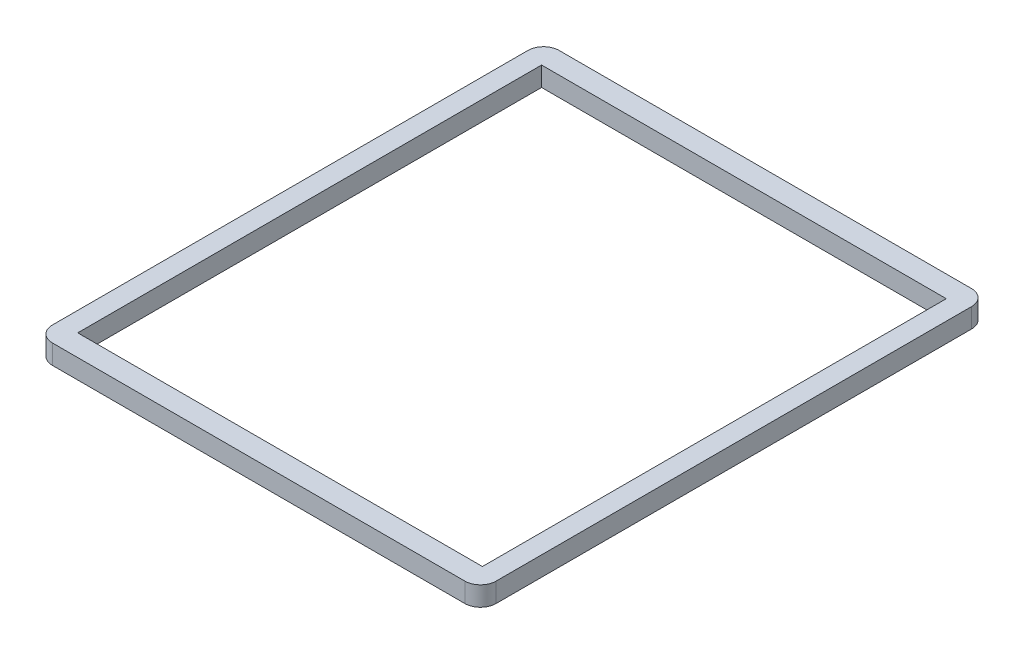
ISO-10303-21;
HEADER;
FILE_DESCRIPTION(('STEP AP214'),'2;1');
FILE_NAME('part.step','',(''),(''),'','','');
FILE_SCHEMA(('AUTOMOTIVE_DESIGN { 1 0 10303 214 1 1 1 1 }'));
ENDSEC;
DATA;
#1=APPLICATION_CONTEXT('core data for automotive mechanical design processes');
#2=APPLICATION_PROTOCOL_DEFINITION('international standard','automotive_design',2000,#1);
#3=PRODUCT_CONTEXT('',#1,'mechanical');
#4=PRODUCT('Part','Part','',(#3));
#5=PRODUCT_RELATED_PRODUCT_CATEGORY('part','',(#4));
#6=PRODUCT_DEFINITION_FORMATION('','',#4);
#7=PRODUCT_DEFINITION_CONTEXT('part definition',#1,'design');
#8=PRODUCT_DEFINITION('design','',#6,#7);
#9=PRODUCT_DEFINITION_SHAPE('','',#8);
#10=(LENGTH_UNIT() NAMED_UNIT(*) SI_UNIT(.MILLI.,.METRE.));
#11=(NAMED_UNIT(*) PLANE_ANGLE_UNIT() SI_UNIT($,.RADIAN.));
#12=(NAMED_UNIT(*) SI_UNIT($,.STERADIAN.) SOLID_ANGLE_UNIT());
#13=UNCERTAINTY_MEASURE_WITH_UNIT(LENGTH_MEASURE(1.E-05),#10,'distance_accuracy_value','');
#14=(GEOMETRIC_REPRESENTATION_CONTEXT(3) GLOBAL_UNCERTAINTY_ASSIGNED_CONTEXT((#13)) GLOBAL_UNIT_ASSIGNED_CONTEXT((#10,
#11,#12)) REPRESENTATION_CONTEXT('',''));
#15=CARTESIAN_POINT('',(0.,0.,0.));
#16=DIRECTION('',(0.,0.,1.));
#17=DIRECTION('',(1.,0.,0.));
#18=AXIS2_PLACEMENT_3D('',#15,#16,#17);
#19=CARTESIAN_POINT('',(2.54,3.175,-2.54));
#20=DIRECTION('',(0.,-1.,0.));
#21=DIRECTION('',(0.,0.,-1.));
#22=AXIS2_PLACEMENT_3D('',#19,#20,#21);
#23=PLANE('',#22);
#24=CARTESIAN_POINT('',(2.54,3.175,-2.54));
#25=DIRECTION('',(0.,1.,0.));
#26=DIRECTION('',(0.,0.,-1.));
#27=AXIS2_PLACEMENT_3D('',#24,#25,#26);
#28=CIRCLE('',#27,2.54);
#29=CARTESIAN_POINT('',(0.,3.175,-2.54000000000002));
#30=VERTEX_POINT('',#29);
#31=CARTESIAN_POINT('',(2.54000000000002,3.175,0.));
#32=VERTEX_POINT('',#31);
#33=EDGE_CURVE('E159',#30,#32,#28,.T.);
#34=ORIENTED_EDGE('',*,*,#33,.T.);
#35=DIRECTION('',(1.,0.,0.));
#36=VECTOR('',#35,1.);
#37=CARTESIAN_POINT('',(2.54000000000002,3.175,0.));
#38=LINE('',#37,#36);
#39=CARTESIAN_POINT('',(69.85,3.175,0.));
#40=VERTEX_POINT('',#39);
#41=EDGE_CURVE('E162',#32,#40,#38,.T.);
#42=ORIENTED_EDGE('',*,*,#41,.T.);
#43=CARTESIAN_POINT('',(69.85,3.175,-2.54000000000001));
#44=DIRECTION('',(0.,1.,0.));
#45=DIRECTION('',(0.,0.,-1.));
#46=AXIS2_PLACEMENT_3D('',#43,#44,#45);
#47=CIRCLE('',#46,2.54);
#48=CARTESIAN_POINT('',(72.39,3.175,-2.54000000000001));
#49=VERTEX_POINT('',#48);
#50=EDGE_CURVE('E165',#40,#49,#47,.T.);
#51=ORIENTED_EDGE('',*,*,#50,.T.);
#52=DIRECTION('',(0.,0.,-1.));
#53=VECTOR('',#52,1.);
#54=CARTESIAN_POINT('',(72.39,3.175,-2.54000000000001));
#55=LINE('',#54,#53);
#56=CARTESIAN_POINT('',(72.39,3.175,-80.137));
#57=VERTEX_POINT('',#56);
#58=EDGE_CURVE('E167',#49,#57,#55,.T.);
#59=ORIENTED_EDGE('',*,*,#58,.T.);
#60=CARTESIAN_POINT('',(69.85,3.175,-80.137));
#61=DIRECTION('',(0.,1.,0.));
#62=DIRECTION('',(0.,0.,-1.));
#63=AXIS2_PLACEMENT_3D('',#60,#61,#62);
#64=CIRCLE('',#63,2.54);
#65=CARTESIAN_POINT('',(69.85,3.175,-82.677));
#66=VERTEX_POINT('',#65);
#67=EDGE_CURVE('E169',#57,#66,#64,.T.);
#68=ORIENTED_EDGE('',*,*,#67,.T.);
#69=DIRECTION('',(-1.,0.,0.));
#70=VECTOR('',#69,1.);
#71=CARTESIAN_POINT('',(2.54000000000002,3.175,-82.677));
#72=LINE('',#71,#70);
#73=CARTESIAN_POINT('',(2.54000000000002,3.175,-82.677));
#74=VERTEX_POINT('',#73);
#75=EDGE_CURVE('E171',#66,#74,#72,.T.);
#76=ORIENTED_EDGE('',*,*,#75,.T.);
#77=CARTESIAN_POINT('',(2.54,3.175,-80.137));
#78=DIRECTION('',(0.,1.,0.));
#79=DIRECTION('',(0.,0.,1.));
#80=AXIS2_PLACEMENT_3D('',#77,#78,#79);
#81=CIRCLE('',#80,2.54);
#82=CARTESIAN_POINT('',(0.,3.175,-80.137));
#83=VERTEX_POINT('',#82);
#84=EDGE_CURVE('E173',#74,#83,#81,.T.);
#85=ORIENTED_EDGE('',*,*,#84,.T.);
#86=DIRECTION('',(0.,0.,1.));
#87=VECTOR('',#86,1.);
#88=CARTESIAN_POINT('',(0.,3.175,-2.54000000000002));
#89=LINE('',#88,#87);
#90=EDGE_CURVE('E175',#83,#30,#89,.T.);
#91=ORIENTED_EDGE('',*,*,#90,.T.);
#92=EDGE_LOOP('',(#34,#42,#51,#59,#68,#76,#85,#91));
#93=FACE_BOUND('',#92,.T.);
#94=DIRECTION('',(0.,0.,1.));
#95=VECTOR('',#94,1.);
#96=CARTESIAN_POINT('',(3.175,3.175,-3.4925));
#97=LINE('',#96,#95);
#98=CARTESIAN_POINT('',(3.175,3.175,-79.1845));
#99=VERTEX_POINT('',#98);
#100=CARTESIAN_POINT('',(3.175,3.175,-3.4925));
#101=VERTEX_POINT('',#100);
#102=EDGE_CURVE('E123',#99,#101,#97,.T.);
#103=ORIENTED_EDGE('',*,*,#102,.F.);
#104=DIRECTION('',(-1.,0.,0.));
#105=VECTOR('',#104,1.);
#106=CARTESIAN_POINT('',(69.215,3.175,-79.1845));
#107=LINE('',#106,#105);
#108=CARTESIAN_POINT('',(69.215,3.175,-79.1845));
#109=VERTEX_POINT('',#108);
#110=EDGE_CURVE('E145',#109,#99,#107,.T.);
#111=ORIENTED_EDGE('',*,*,#110,.F.);
#112=DIRECTION('',(0.,0.,-1.));
#113=VECTOR('',#112,1.);
#114=CARTESIAN_POINT('',(69.215,3.175,-3.49250000000001));
#115=LINE('',#114,#113);
#116=CARTESIAN_POINT('',(69.215,3.175,-3.49250000000001));
#117=VERTEX_POINT('',#116);
#118=EDGE_CURVE('E143',#117,#109,#115,.T.);
#119=ORIENTED_EDGE('',*,*,#118,.F.);
#120=DIRECTION('',(1.,0.,0.));
#121=VECTOR('',#120,1.);
#122=CARTESIAN_POINT('',(69.215,3.175,-3.49250000000001));
#123=LINE('',#122,#121);
#124=EDGE_CURVE('E131',#101,#117,#123,.T.);
#125=ORIENTED_EDGE('',*,*,#124,.F.);
#126=EDGE_LOOP('',(#103,#111,#119,#125));
#127=FACE_BOUND('',#126,.T.);
#128=ADVANCED_FACE('F34',(#93,#127),#23,.F.);
#129=CARTESIAN_POINT('',(2.54,0.,-2.54));
#130=DIRECTION('',(0.,-1.,0.));
#131=DIRECTION('',(0.,0.,-1.));
#132=AXIS2_PLACEMENT_3D('',#129,#130,#131);
#133=PLANE('',#132);
#134=CARTESIAN_POINT('',(2.54,0.,-2.54));
#135=DIRECTION('',(0.,1.,0.));
#136=DIRECTION('',(0.,0.,-1.));
#137=AXIS2_PLACEMENT_3D('',#134,#135,#136);
#138=CIRCLE('',#137,2.54);
#139=CARTESIAN_POINT('',(0.,0.,-2.54000000000002));
#140=VERTEX_POINT('',#139);
#141=CARTESIAN_POINT('',(2.54000000000002,0.,0.));
#142=VERTEX_POINT('',#141);
#143=EDGE_CURVE('E139',#140,#142,#138,.T.);
#144=ORIENTED_EDGE('',*,*,#143,.F.);
#145=DIRECTION('',(0.,0.,1.));
#146=VECTOR('',#145,1.);
#147=CARTESIAN_POINT('',(0.,0.,-2.54000000000002));
#148=LINE('',#147,#146);
#149=CARTESIAN_POINT('',(0.,0.,-80.137));
#150=VERTEX_POINT('',#149);
#151=EDGE_CURVE('E163',#150,#140,#148,.T.);
#152=ORIENTED_EDGE('',*,*,#151,.F.);
#153=CARTESIAN_POINT('',(2.54,0.,-80.137));
#154=DIRECTION('',(0.,1.,0.));
#155=DIRECTION('',(0.,0.,1.));
#156=AXIS2_PLACEMENT_3D('',#153,#154,#155);
#157=CIRCLE('',#156,2.54);
#158=CARTESIAN_POINT('',(2.54000000000002,0.,-82.677));
#159=VERTEX_POINT('',#158);
#160=EDGE_CURVE('E190',#159,#150,#157,.T.);
#161=ORIENTED_EDGE('',*,*,#160,.F.);
#162=DIRECTION('',(-1.,0.,0.));
#163=VECTOR('',#162,1.);
#164=CARTESIAN_POINT('',(2.54000000000002,0.,-82.677));
#165=LINE('',#164,#163);
#166=CARTESIAN_POINT('',(69.85,0.,-82.677));
#167=VERTEX_POINT('',#166);
#168=EDGE_CURVE('E188',#167,#159,#165,.T.);
#169=ORIENTED_EDGE('',*,*,#168,.F.);
#170=CARTESIAN_POINT('',(69.85,0.,-80.137));
#171=DIRECTION('',(0.,1.,0.));
#172=DIRECTION('',(0.,0.,-1.));
#173=AXIS2_PLACEMENT_3D('',#170,#171,#172);
#174=CIRCLE('',#173,2.54);
#175=CARTESIAN_POINT('',(72.39,0.,-80.137));
#176=VERTEX_POINT('',#175);
#177=EDGE_CURVE('E186',#176,#167,#174,.T.);
#178=ORIENTED_EDGE('',*,*,#177,.F.);
#179=DIRECTION('',(0.,0.,-1.));
#180=VECTOR('',#179,1.);
#181=CARTESIAN_POINT('',(72.39,0.,-2.54000000000001));
#182=LINE('',#181,#180);
#183=CARTESIAN_POINT('',(72.39,0.,-2.54000000000001));
#184=VERTEX_POINT('',#183);
#185=EDGE_CURVE('E184',#184,#176,#182,.T.);
#186=ORIENTED_EDGE('',*,*,#185,.F.);
#187=CARTESIAN_POINT('',(69.85,0.,-2.54000000000001));
#188=DIRECTION('',(0.,1.,0.));
#189=DIRECTION('',(0.,0.,-1.));
#190=AXIS2_PLACEMENT_3D('',#187,#188,#189);
#191=CIRCLE('',#190,2.54);
#192=CARTESIAN_POINT('',(69.85,0.,0.));
#193=VERTEX_POINT('',#192);
#194=EDGE_CURVE('E182',#193,#184,#191,.T.);
#195=ORIENTED_EDGE('',*,*,#194,.F.);
#196=DIRECTION('',(1.,0.,0.));
#197=VECTOR('',#196,1.);
#198=CARTESIAN_POINT('',(2.54000000000002,0.,0.));
#199=LINE('',#198,#197);
#200=EDGE_CURVE('E180',#142,#193,#199,.T.);
#201=ORIENTED_EDGE('',*,*,#200,.F.);
#202=EDGE_LOOP('',(#144,#152,#161,#169,#178,#186,#195,#201));
#203=FACE_BOUND('',#202,.T.);
#204=DIRECTION('',(-1.,0.,0.));
#205=VECTOR('',#204,1.);
#206=CARTESIAN_POINT('',(69.215,0.,-79.1845));
#207=LINE('',#206,#205);
#208=CARTESIAN_POINT('',(69.215,0.,-79.1845));
#209=VERTEX_POINT('',#208);
#210=CARTESIAN_POINT('',(3.175,0.,-79.1845));
#211=VERTEX_POINT('',#210);
#212=EDGE_CURVE('E132',#209,#211,#207,.T.);
#213=ORIENTED_EDGE('',*,*,#212,.T.);
#214=DIRECTION('',(0.,0.,1.));
#215=VECTOR('',#214,1.);
#216=CARTESIAN_POINT('',(3.175,0.,-3.4925));
#217=LINE('',#216,#215);
#218=CARTESIAN_POINT('',(3.175,0.,-3.4925));
#219=VERTEX_POINT('',#218);
#220=EDGE_CURVE('E57',#211,#219,#217,.T.);
#221=ORIENTED_EDGE('',*,*,#220,.T.);
#222=DIRECTION('',(1.,0.,0.));
#223=VECTOR('',#222,1.);
#224=CARTESIAN_POINT('',(69.215,0.,-3.49250000000001));
#225=LINE('',#224,#223);
#226=CARTESIAN_POINT('',(69.215,0.,-3.49250000000001));
#227=VERTEX_POINT('',#226);
#228=EDGE_CURVE('E138',#219,#227,#225,.T.);
#229=ORIENTED_EDGE('',*,*,#228,.T.);
#230=DIRECTION('',(0.,0.,-1.));
#231=VECTOR('',#230,1.);
#232=CARTESIAN_POINT('',(69.215,0.,-3.49250000000001));
#233=LINE('',#232,#231);
#234=EDGE_CURVE('E151',#227,#209,#233,.T.);
#235=ORIENTED_EDGE('',*,*,#234,.T.);
#236=EDGE_LOOP('',(#213,#221,#229,#235));
#237=FACE_BOUND('',#236,.T.);
#238=ADVANCED_FACE('F220',(#203,#237),#133,.T.);
#239=CARTESIAN_POINT('',(2.54,3.175,-2.54));
#240=DIRECTION('',(0.,-1.,0.));
#241=DIRECTION('',(0.,0.,-1.));
#242=AXIS2_PLACEMENT_3D('',#239,#240,#241);
#243=CYLINDRICAL_SURFACE('',#242,2.54);
#244=ORIENTED_EDGE('',*,*,#143,.T.);
#245=DIRECTION('',(0.,-1.,0.));
#246=VECTOR('',#245,1.);
#247=CARTESIAN_POINT('',(2.54000000000002,3.175,0.));
#248=LINE('',#247,#246);
#249=EDGE_CURVE('E11',#32,#142,#248,.T.);
#250=ORIENTED_EDGE('',*,*,#249,.F.);
#251=ORIENTED_EDGE('',*,*,#33,.F.);
#252=DIRECTION('',(0.,-1.,0.));
#253=VECTOR('',#252,1.);
#254=CARTESIAN_POINT('',(0.,3.175,-2.54000000000002));
#255=LINE('',#254,#253);
#256=EDGE_CURVE('E177',#30,#140,#255,.T.);
#257=ORIENTED_EDGE('',*,*,#256,.T.);
#258=EDGE_LOOP('',(#244,#250,#251,#257));
#259=FACE_BOUND('',#258,.T.);
#260=ADVANCED_FACE('F36',(#259),#243,.T.);
#261=CARTESIAN_POINT('',(2.54000000000002,3.175,0.));
#262=DIRECTION('',(0.,0.,-1.));
#263=DIRECTION('',(-1.,0.,0.));
#264=AXIS2_PLACEMENT_3D('',#261,#262,#263);
#265=PLANE('',#264);
#266=ORIENTED_EDGE('',*,*,#200,.T.);
#267=DIRECTION('',(0.,-1.,0.));
#268=VECTOR('',#267,1.);
#269=CARTESIAN_POINT('',(69.85,3.175,0.));
#270=LINE('',#269,#268);
#271=EDGE_CURVE('E42',#40,#193,#270,.T.);
#272=ORIENTED_EDGE('',*,*,#271,.F.);
#273=ORIENTED_EDGE('',*,*,#41,.F.);
#274=ORIENTED_EDGE('',*,*,#249,.T.);
#275=EDGE_LOOP('',(#266,#272,#273,#274));
#276=FACE_BOUND('',#275,.T.);
#277=ADVANCED_FACE('F237',(#276),#265,.F.);
#278=CARTESIAN_POINT('',(69.85,3.175,-2.54000000000001));
#279=DIRECTION('',(0.,-1.,0.));
#280=DIRECTION('',(0.,0.,-1.));
#281=AXIS2_PLACEMENT_3D('',#278,#279,#280);
#282=CYLINDRICAL_SURFACE('',#281,2.54);
#283=ORIENTED_EDGE('',*,*,#194,.T.);
#284=DIRECTION('',(0.,-1.,0.));
#285=VECTOR('',#284,1.);
#286=CARTESIAN_POINT('',(72.39,3.175,-2.54000000000001));
#287=LINE('',#286,#285);
#288=EDGE_CURVE('E207',#49,#184,#287,.T.);
#289=ORIENTED_EDGE('',*,*,#288,.F.);
#290=ORIENTED_EDGE('',*,*,#50,.F.);
#291=ORIENTED_EDGE('',*,*,#271,.T.);
#292=EDGE_LOOP('',(#283,#289,#290,#291));
#293=FACE_BOUND('',#292,.T.);
#294=ADVANCED_FACE('F214',(#293),#282,.T.);
#295=CARTESIAN_POINT('',(72.39,3.175,-2.54000000000001));
#296=DIRECTION('',(-1.,0.,0.));
#297=DIRECTION('',(0.,0.,1.));
#298=AXIS2_PLACEMENT_3D('',#295,#296,#297);
#299=PLANE('',#298);
#300=ORIENTED_EDGE('',*,*,#185,.T.);
#301=DIRECTION('',(0.,-1.,0.));
#302=VECTOR('',#301,1.);
#303=CARTESIAN_POINT('',(72.39,3.175,-80.137));
#304=LINE('',#303,#302);
#305=EDGE_CURVE('E204',#57,#176,#304,.T.);
#306=ORIENTED_EDGE('',*,*,#305,.F.);
#307=ORIENTED_EDGE('',*,*,#58,.F.);
#308=ORIENTED_EDGE('',*,*,#288,.T.);
#309=EDGE_LOOP('',(#300,#306,#307,#308));
#310=FACE_BOUND('',#309,.T.);
#311=ADVANCED_FACE('F226',(#310),#299,.F.);
#312=CARTESIAN_POINT('',(69.85,3.175,-80.137));
#313=DIRECTION('',(0.,-1.,0.));
#314=DIRECTION('',(0.,0.,-1.));
#315=AXIS2_PLACEMENT_3D('',#312,#313,#314);
#316=CYLINDRICAL_SURFACE('',#315,2.54);
#317=ORIENTED_EDGE('',*,*,#177,.T.);
#318=DIRECTION('',(0.,-1.,0.));
#319=VECTOR('',#318,1.);
#320=CARTESIAN_POINT('',(69.85,3.175,-82.677));
#321=LINE('',#320,#319);
#322=EDGE_CURVE('E201',#66,#167,#321,.T.);
#323=ORIENTED_EDGE('',*,*,#322,.F.);
#324=ORIENTED_EDGE('',*,*,#67,.F.);
#325=ORIENTED_EDGE('',*,*,#305,.T.);
#326=EDGE_LOOP('',(#317,#323,#324,#325));
#327=FACE_BOUND('',#326,.T.);
#328=ADVANCED_FACE('F230',(#327),#316,.T.);
#329=CARTESIAN_POINT('',(2.54000000000002,3.175,-82.677));
#330=DIRECTION('',(0.,0.,1.));
#331=DIRECTION('',(1.,0.,0.));
#332=AXIS2_PLACEMENT_3D('',#329,#330,#331);
#333=PLANE('',#332);
#334=ORIENTED_EDGE('',*,*,#168,.T.);
#335=DIRECTION('',(0.,-1.,0.));
#336=VECTOR('',#335,1.);
#337=CARTESIAN_POINT('',(2.54000000000002,3.175,-82.677));
#338=LINE('',#337,#336);
#339=EDGE_CURVE('E198',#74,#159,#338,.T.);
#340=ORIENTED_EDGE('',*,*,#339,.F.);
#341=ORIENTED_EDGE('',*,*,#75,.F.);
#342=ORIENTED_EDGE('',*,*,#322,.T.);
#343=EDGE_LOOP('',(#334,#340,#341,#342));
#344=FACE_BOUND('',#343,.T.);
#345=ADVANCED_FACE('F250',(#344),#333,.F.);
#346=CARTESIAN_POINT('',(2.54,3.175,-80.137));
#347=DIRECTION('',(0.,-1.,0.));
#348=DIRECTION('',(0.,0.,-1.));
#349=AXIS2_PLACEMENT_3D('',#346,#347,#348);
#350=CYLINDRICAL_SURFACE('',#349,2.54);
#351=ORIENTED_EDGE('',*,*,#160,.T.);
#352=DIRECTION('',(0.,-1.,0.));
#353=VECTOR('',#352,1.);
#354=CARTESIAN_POINT('',(0.,3.175,-80.137));
#355=LINE('',#354,#353);
#356=EDGE_CURVE('E195',#83,#150,#355,.T.);
#357=ORIENTED_EDGE('',*,*,#356,.F.);
#358=ORIENTED_EDGE('',*,*,#84,.F.);
#359=ORIENTED_EDGE('',*,*,#339,.T.);
#360=EDGE_LOOP('',(#351,#357,#358,#359));
#361=FACE_BOUND('',#360,.T.);
#362=ADVANCED_FACE('F248',(#361),#350,.T.);
#363=CARTESIAN_POINT('',(0.,3.175,-2.54000000000002));
#364=DIRECTION('',(1.,0.,0.));
#365=DIRECTION('',(0.,0.,-1.));
#366=AXIS2_PLACEMENT_3D('',#363,#364,#365);
#367=PLANE('',#366);
#368=ORIENTED_EDGE('',*,*,#151,.T.);
#369=ORIENTED_EDGE('',*,*,#256,.F.);
#370=ORIENTED_EDGE('',*,*,#90,.F.);
#371=ORIENTED_EDGE('',*,*,#356,.T.);
#372=EDGE_LOOP('',(#368,#369,#370,#371));
#373=FACE_BOUND('',#372,.T.);
#374=ADVANCED_FACE('F243',(#373),#367,.F.);
#375=CARTESIAN_POINT('',(3.175,3.175,-3.4925));
#376=DIRECTION('',(1.,0.,0.));
#377=DIRECTION('',(0.,0.,-1.));
#378=AXIS2_PLACEMENT_3D('',#375,#376,#377);
#379=PLANE('',#378);
#380=ORIENTED_EDGE('',*,*,#220,.F.);
#381=DIRECTION('',(0.,-1.,0.));
#382=VECTOR('',#381,1.);
#383=CARTESIAN_POINT('',(3.175,3.175,-79.1845));
#384=LINE('',#383,#382);
#385=EDGE_CURVE('E127',#99,#211,#384,.T.);
#386=ORIENTED_EDGE('',*,*,#385,.F.);
#387=ORIENTED_EDGE('',*,*,#102,.T.);
#388=DIRECTION('',(0.,-1.,0.));
#389=VECTOR('',#388,1.);
#390=CARTESIAN_POINT('',(3.175,3.175,-3.4925));
#391=LINE('',#390,#389);
#392=EDGE_CURVE('E126',#101,#219,#391,.T.);
#393=ORIENTED_EDGE('',*,*,#392,.T.);
#394=EDGE_LOOP('',(#380,#386,#387,#393));
#395=FACE_BOUND('',#394,.T.);
#396=ADVANCED_FACE('F125',(#395),#379,.T.);
#397=CARTESIAN_POINT('',(69.215,3.175,-3.49250000000001));
#398=DIRECTION('',(0.,0.,-1.));
#399=DIRECTION('',(-1.,0.,0.));
#400=AXIS2_PLACEMENT_3D('',#397,#398,#399);
#401=PLANE('',#400);
#402=ORIENTED_EDGE('',*,*,#228,.F.);
#403=ORIENTED_EDGE('',*,*,#392,.F.);
#404=ORIENTED_EDGE('',*,*,#124,.T.);
#405=DIRECTION('',(0.,-1.,0.));
#406=VECTOR('',#405,1.);
#407=CARTESIAN_POINT('',(69.215,3.175,-3.49250000000001));
#408=LINE('',#407,#406);
#409=EDGE_CURVE('E140',#117,#227,#408,.T.);
#410=ORIENTED_EDGE('',*,*,#409,.T.);
#411=EDGE_LOOP('',(#402,#403,#404,#410));
#412=FACE_BOUND('',#411,.T.);
#413=ADVANCED_FACE('F135',(#412),#401,.T.);
#414=CARTESIAN_POINT('',(69.215,3.175,-3.49250000000001));
#415=DIRECTION('',(-1.,0.,0.));
#416=DIRECTION('',(0.,0.,1.));
#417=AXIS2_PLACEMENT_3D('',#414,#415,#416);
#418=PLANE('',#417);
#419=ORIENTED_EDGE('',*,*,#234,.F.);
#420=ORIENTED_EDGE('',*,*,#409,.F.);
#421=ORIENTED_EDGE('',*,*,#118,.T.);
#422=DIRECTION('',(0.,-1.,0.));
#423=VECTOR('',#422,1.);
#424=CARTESIAN_POINT('',(69.215,3.175,-79.1845));
#425=LINE('',#424,#423);
#426=EDGE_CURVE('E49',#109,#209,#425,.T.);
#427=ORIENTED_EDGE('',*,*,#426,.T.);
#428=EDGE_LOOP('',(#419,#420,#421,#427));
#429=FACE_BOUND('',#428,.T.);
#430=ADVANCED_FACE('F275',(#429),#418,.T.);
#431=CARTESIAN_POINT('',(69.215,3.175,-79.1845));
#432=DIRECTION('',(0.,0.,1.));
#433=DIRECTION('',(1.,0.,0.));
#434=AXIS2_PLACEMENT_3D('',#431,#432,#433);
#435=PLANE('',#434);
#436=ORIENTED_EDGE('',*,*,#212,.F.);
#437=ORIENTED_EDGE('',*,*,#426,.F.);
#438=ORIENTED_EDGE('',*,*,#110,.T.);
#439=ORIENTED_EDGE('',*,*,#385,.T.);
#440=EDGE_LOOP('',(#436,#437,#438,#439));
#441=FACE_BOUND('',#440,.T.);
#442=ADVANCED_FACE('F279',(#441),#435,.T.);
#443=CLOSED_SHELL('',(#128,#238,#260,#277,#294,#311,#328,#345,#362,#374,#396,#413,#430,#442));
#444=MANIFOLD_SOLID_BREP('B2',#443);
#445=ADVANCED_BREP_SHAPE_REPRESENTATION('',(#18,#444),#14);
#446=SHAPE_DEFINITION_REPRESENTATION(#9,#445);
ENDSEC;
END-ISO-10303-21;
